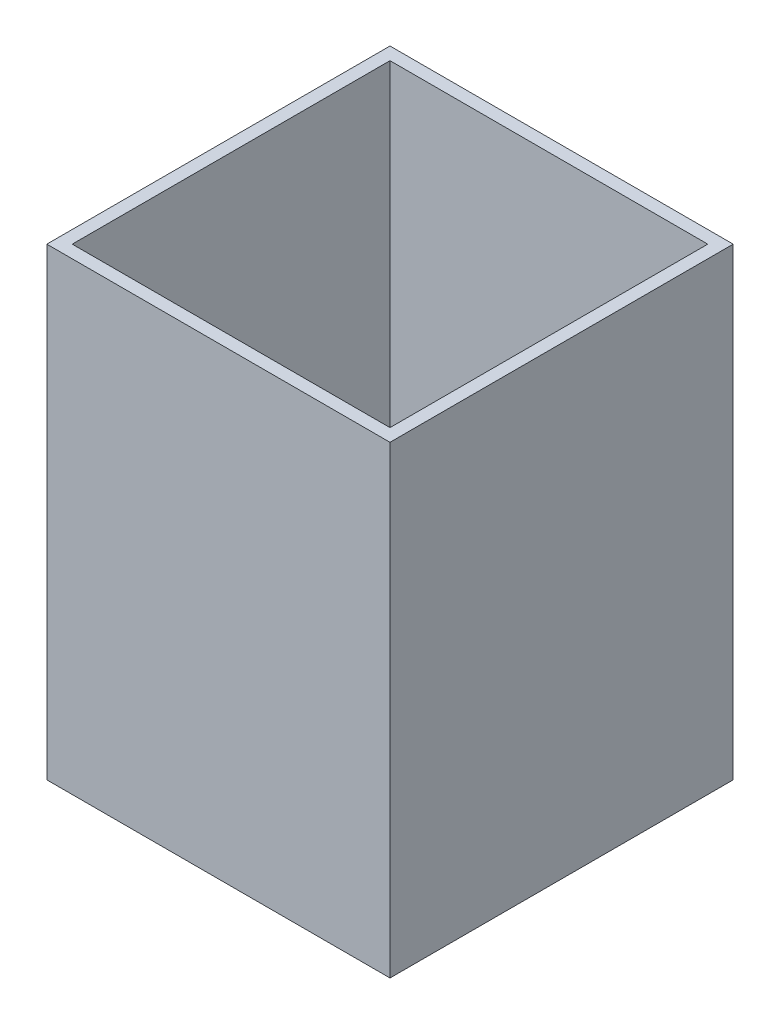
ISO-10303-21;
HEADER;
FILE_DESCRIPTION(('STEP AP214'),'2;1');
FILE_NAME('part.step','',(''),(''),'','','');
FILE_SCHEMA(('AUTOMOTIVE_DESIGN { 1 0 10303 214 1 1 1 1 }'));
ENDSEC;
DATA;
#1=APPLICATION_CONTEXT('core data for automotive mechanical design processes');
#2=APPLICATION_PROTOCOL_DEFINITION('international standard','automotive_design',2000,#1);
#3=PRODUCT_CONTEXT('',#1,'mechanical');
#4=PRODUCT('Part','Part','',(#3));
#5=PRODUCT_RELATED_PRODUCT_CATEGORY('part','',(#4));
#6=PRODUCT_DEFINITION_FORMATION('','',#4);
#7=PRODUCT_DEFINITION_CONTEXT('part definition',#1,'design');
#8=PRODUCT_DEFINITION('design','',#6,#7);
#9=PRODUCT_DEFINITION_SHAPE('','',#8);
#10=(LENGTH_UNIT() NAMED_UNIT(*) SI_UNIT(.MILLI.,.METRE.));
#11=(NAMED_UNIT(*) PLANE_ANGLE_UNIT() SI_UNIT($,.RADIAN.));
#12=(NAMED_UNIT(*) SI_UNIT($,.STERADIAN.) SOLID_ANGLE_UNIT());
#13=UNCERTAINTY_MEASURE_WITH_UNIT(LENGTH_MEASURE(1.E-05),#10,'distance_accuracy_value','');
#14=(GEOMETRIC_REPRESENTATION_CONTEXT(3) GLOBAL_UNCERTAINTY_ASSIGNED_CONTEXT((#13)) GLOBAL_UNIT_ASSIGNED_CONTEXT((#10,
#11,#12)) REPRESENTATION_CONTEXT('',''));
#15=CARTESIAN_POINT('',(0.,0.,0.));
#16=DIRECTION('',(0.,0.,1.));
#17=DIRECTION('',(1.,0.,0.));
#18=AXIS2_PLACEMENT_3D('',#15,#16,#17);
#19=CARTESIAN_POINT('',(0.,0.,0.));
#20=DIRECTION('',(0.,-1.,0.));
#21=DIRECTION('',(0.,0.,-1.));
#22=AXIS2_PLACEMENT_3D('',#19,#20,#21);
#23=PLANE('',#22);
#24=DIRECTION('',(0.,0.,-1.));
#25=VECTOR('',#24,1.);
#26=CARTESIAN_POINT('',(27.,0.,27.));
#27=LINE('',#26,#25);
#28=CARTESIAN_POINT('',(27.,0.,27.));
#29=VERTEX_POINT('',#28);
#30=CARTESIAN_POINT('',(27.,0.,-27.));
#31=VERTEX_POINT('',#30);
#32=EDGE_CURVE('E132',#29,#31,#27,.T.);
#33=ORIENTED_EDGE('',*,*,#32,.F.);
#34=DIRECTION('',(1.,0.,0.));
#35=VECTOR('',#34,1.);
#36=CARTESIAN_POINT('',(-27.,0.,27.));
#37=LINE('',#36,#35);
#38=CARTESIAN_POINT('',(-27.,0.,27.));
#39=VERTEX_POINT('',#38);
#40=EDGE_CURVE('E222',#39,#29,#37,.T.);
#41=ORIENTED_EDGE('',*,*,#40,.F.);
#42=DIRECTION('',(0.,0.,1.));
#43=VECTOR('',#42,1.);
#44=CARTESIAN_POINT('',(-27.,0.,27.));
#45=LINE('',#44,#43);
#46=CARTESIAN_POINT('',(-27.,0.,-27.));
#47=VERTEX_POINT('',#46);
#48=EDGE_CURVE('E220',#47,#39,#45,.T.);
#49=ORIENTED_EDGE('',*,*,#48,.F.);
#50=DIRECTION('',(-1.,0.,0.));
#51=VECTOR('',#50,1.);
#52=CARTESIAN_POINT('',(-27.,0.,-27.));
#53=LINE('',#52,#51);
#54=EDGE_CURVE('E218',#31,#47,#53,.T.);
#55=ORIENTED_EDGE('',*,*,#54,.F.);
#56=EDGE_LOOP('',(#33,#41,#49,#55));
#57=FACE_BOUND('',#56,.T.);
#58=DIRECTION('',(1.,0.,0.));
#59=VECTOR('',#58,1.);
#60=CARTESIAN_POINT('',(-25.,0.,25.));
#61=LINE('',#60,#59);
#62=CARTESIAN_POINT('',(-25.,0.,25.));
#63=VERTEX_POINT('',#62);
#64=CARTESIAN_POINT('',(25.,0.,25.));
#65=VERTEX_POINT('',#64);
#66=EDGE_CURVE('E191',#63,#65,#61,.T.);
#67=ORIENTED_EDGE('',*,*,#66,.T.);
#68=DIRECTION('',(0.,0.,-1.));
#69=VECTOR('',#68,1.);
#70=CARTESIAN_POINT('',(25.,0.,25.));
#71=LINE('',#70,#69);
#72=CARTESIAN_POINT('',(25.,0.,-25.));
#73=VERTEX_POINT('',#72);
#74=EDGE_CURVE('E58',#65,#73,#71,.T.);
#75=ORIENTED_EDGE('',*,*,#74,.T.);
#76=DIRECTION('',(-1.,0.,0.));
#77=VECTOR('',#76,1.);
#78=CARTESIAN_POINT('',(-25.,0.,-25.));
#79=LINE('',#78,#77);
#80=CARTESIAN_POINT('',(-25.,0.,-25.));
#81=VERTEX_POINT('',#80);
#82=EDGE_CURVE('E202',#73,#81,#79,.T.);
#83=ORIENTED_EDGE('',*,*,#82,.T.);
#84=DIRECTION('',(0.,0.,1.));
#85=VECTOR('',#84,1.);
#86=CARTESIAN_POINT('',(-25.,0.,25.));
#87=LINE('',#86,#85);
#88=EDGE_CURVE('E205',#81,#63,#87,.T.);
#89=ORIENTED_EDGE('',*,*,#88,.T.);
#90=EDGE_LOOP('',(#67,#75,#83,#89));
#91=FACE_BOUND('',#90,.T.);
#92=ADVANCED_FACE('F35',(#57,#91),#23,.T.);
#93=CARTESIAN_POINT('',(27.,22.,27.));
#94=DIRECTION('',(-1.,0.,0.));
#95=DIRECTION('',(0.,0.,1.));
#96=AXIS2_PLACEMENT_3D('',#93,#94,#95);
#97=PLANE('',#96);
#98=ORIENTED_EDGE('',*,*,#32,.T.);
#99=DIRECTION('',(0.,-1.,0.));
#100=VECTOR('',#99,1.);
#101=CARTESIAN_POINT('',(27.,22.,-27.));
#102=LINE('',#101,#100);
#103=CARTESIAN_POINT('',(27.,73.,-27.));
#104=VERTEX_POINT('',#103);
#105=EDGE_CURVE('E11',#104,#31,#102,.T.);
#106=ORIENTED_EDGE('',*,*,#105,.F.);
#107=DIRECTION('',(0.,0.,-1.));
#108=VECTOR('',#107,1.);
#109=CARTESIAN_POINT('',(27.,73.,0.));
#110=LINE('',#109,#108);
#111=CARTESIAN_POINT('',(27.,73.,27.));
#112=VERTEX_POINT('',#111);
#113=EDGE_CURVE('E130',#112,#104,#110,.T.);
#114=ORIENTED_EDGE('',*,*,#113,.F.);
#115=DIRECTION('',(0.,-1.,0.));
#116=VECTOR('',#115,1.);
#117=CARTESIAN_POINT('',(27.,22.,27.));
#118=LINE('',#117,#116);
#119=EDGE_CURVE('E224',#112,#29,#118,.T.);
#120=ORIENTED_EDGE('',*,*,#119,.T.);
#121=EDGE_LOOP('',(#98,#106,#114,#120));
#122=FACE_BOUND('',#121,.T.);
#123=ADVANCED_FACE('F37',(#122),#97,.F.);
#124=CARTESIAN_POINT('',(-27.,22.,-27.));
#125=DIRECTION('',(0.,0.,1.));
#126=DIRECTION('',(1.,0.,0.));
#127=AXIS2_PLACEMENT_3D('',#124,#125,#126);
#128=PLANE('',#127);
#129=ORIENTED_EDGE('',*,*,#54,.T.);
#130=DIRECTION('',(0.,-1.,0.));
#131=VECTOR('',#130,1.);
#132=CARTESIAN_POINT('',(-27.,22.,-27.));
#133=LINE('',#132,#131);
#134=CARTESIAN_POINT('',(-27.,73.,-27.));
#135=VERTEX_POINT('',#134);
#136=EDGE_CURVE('E43',#135,#47,#133,.T.);
#137=ORIENTED_EDGE('',*,*,#136,.F.);
#138=DIRECTION('',(-1.,0.,0.));
#139=VECTOR('',#138,1.);
#140=CARTESIAN_POINT('',(0.,73.,-27.));
#141=LINE('',#140,#139);
#142=EDGE_CURVE('E135',#104,#135,#141,.T.);
#143=ORIENTED_EDGE('',*,*,#142,.F.);
#144=ORIENTED_EDGE('',*,*,#105,.T.);
#145=EDGE_LOOP('',(#129,#137,#143,#144));
#146=FACE_BOUND('',#145,.T.);
#147=ADVANCED_FACE('F136',(#146),#128,.F.);
#148=CARTESIAN_POINT('',(-27.,22.,27.));
#149=DIRECTION('',(1.,0.,0.));
#150=DIRECTION('',(0.,0.,-1.));
#151=AXIS2_PLACEMENT_3D('',#148,#149,#150);
#152=PLANE('',#151);
#153=ORIENTED_EDGE('',*,*,#48,.T.);
#154=DIRECTION('',(0.,-1.,0.));
#155=VECTOR('',#154,1.);
#156=CARTESIAN_POINT('',(-27.,22.,27.));
#157=LINE('',#156,#155);
#158=CARTESIAN_POINT('',(-27.,73.,27.));
#159=VERTEX_POINT('',#158);
#160=EDGE_CURVE('E226',#159,#39,#157,.T.);
#161=ORIENTED_EDGE('',*,*,#160,.F.);
#162=DIRECTION('',(0.,0.,1.));
#163=VECTOR('',#162,1.);
#164=CARTESIAN_POINT('',(-27.,73.,0.));
#165=LINE('',#164,#163);
#166=EDGE_CURVE('E141',#135,#159,#165,.T.);
#167=ORIENTED_EDGE('',*,*,#166,.F.);
#168=ORIENTED_EDGE('',*,*,#136,.T.);
#169=EDGE_LOOP('',(#153,#161,#167,#168));
#170=FACE_BOUND('',#169,.T.);
#171=ADVANCED_FACE('F230',(#170),#152,.F.);
#172=CARTESIAN_POINT('',(-27.,22.,27.));
#173=DIRECTION('',(0.,0.,-1.));
#174=DIRECTION('',(-1.,0.,0.));
#175=AXIS2_PLACEMENT_3D('',#172,#173,#174);
#176=PLANE('',#175);
#177=ORIENTED_EDGE('',*,*,#40,.T.);
#178=ORIENTED_EDGE('',*,*,#119,.F.);
#179=DIRECTION('',(1.,0.,0.));
#180=VECTOR('',#179,1.);
#181=CARTESIAN_POINT('',(0.,73.,27.));
#182=LINE('',#181,#180);
#183=EDGE_CURVE('E147',#159,#112,#182,.T.);
#184=ORIENTED_EDGE('',*,*,#183,.F.);
#185=ORIENTED_EDGE('',*,*,#160,.T.);
#186=EDGE_LOOP('',(#177,#178,#184,#185));
#187=FACE_BOUND('',#186,.T.);
#188=ADVANCED_FACE('F235',(#187),#176,.F.);
#189=CARTESIAN_POINT('',(25.,22.,25.));
#190=DIRECTION('',(-1.,0.,0.));
#191=DIRECTION('',(0.,0.,1.));
#192=AXIS2_PLACEMENT_3D('',#189,#190,#191);
#193=PLANE('',#192);
#194=ORIENTED_EDGE('',*,*,#74,.F.);
#195=DIRECTION('',(0.,-1.,0.));
#196=VECTOR('',#195,1.);
#197=CARTESIAN_POINT('',(25.,22.,25.));
#198=LINE('',#197,#196);
#199=CARTESIAN_POINT('',(25.,22.,25.));
#200=VERTEX_POINT('',#199);
#201=EDGE_CURVE('E200',#200,#65,#198,.T.);
#202=ORIENTED_EDGE('',*,*,#201,.F.);
#203=DIRECTION('',(0.,0.,-1.));
#204=VECTOR('',#203,1.);
#205=CARTESIAN_POINT('',(25.,22.,25.));
#206=LINE('',#205,#204);
#207=CARTESIAN_POINT('',(25.,22.,-25.));
#208=VERTEX_POINT('',#207);
#209=EDGE_CURVE('E187',#200,#208,#206,.T.);
#210=ORIENTED_EDGE('',*,*,#209,.T.);
#211=DIRECTION('',(0.,-1.,0.));
#212=VECTOR('',#211,1.);
#213=CARTESIAN_POINT('',(25.,22.,-25.));
#214=LINE('',#213,#212);
#215=EDGE_CURVE('E215',#208,#73,#214,.T.);
#216=ORIENTED_EDGE('',*,*,#215,.T.);
#217=EDGE_LOOP('',(#194,#202,#210,#216));
#218=FACE_BOUND('',#217,.T.);
#219=ADVANCED_FACE('F237',(#218),#193,.T.);
#220=CARTESIAN_POINT('',(-25.,22.,-25.));
#221=DIRECTION('',(0.,0.,1.));
#222=DIRECTION('',(1.,0.,0.));
#223=AXIS2_PLACEMENT_3D('',#220,#221,#222);
#224=PLANE('',#223);
#225=ORIENTED_EDGE('',*,*,#82,.F.);
#226=ORIENTED_EDGE('',*,*,#215,.F.);
#227=DIRECTION('',(-1.,0.,0.));
#228=VECTOR('',#227,1.);
#229=CARTESIAN_POINT('',(-25.,22.,-25.));
#230=LINE('',#229,#228);
#231=CARTESIAN_POINT('',(-25.,22.,-25.));
#232=VERTEX_POINT('',#231);
#233=EDGE_CURVE('E190',#208,#232,#230,.T.);
#234=ORIENTED_EDGE('',*,*,#233,.T.);
#235=DIRECTION('',(0.,-1.,0.));
#236=VECTOR('',#235,1.);
#237=CARTESIAN_POINT('',(-25.,22.,-25.));
#238=LINE('',#237,#236);
#239=EDGE_CURVE('E213',#232,#81,#238,.T.);
#240=ORIENTED_EDGE('',*,*,#239,.T.);
#241=EDGE_LOOP('',(#225,#226,#234,#240));
#242=FACE_BOUND('',#241,.T.);
#243=ADVANCED_FACE('F243',(#242),#224,.T.);
#244=CARTESIAN_POINT('',(-25.,22.,25.));
#245=DIRECTION('',(1.,0.,0.));
#246=DIRECTION('',(0.,0.,-1.));
#247=AXIS2_PLACEMENT_3D('',#244,#245,#246);
#248=PLANE('',#247);
#249=ORIENTED_EDGE('',*,*,#88,.F.);
#250=ORIENTED_EDGE('',*,*,#239,.F.);
#251=DIRECTION('',(0.,0.,1.));
#252=VECTOR('',#251,1.);
#253=CARTESIAN_POINT('',(-25.,22.,25.));
#254=LINE('',#253,#252);
#255=CARTESIAN_POINT('',(-25.,22.,25.));
#256=VERTEX_POINT('',#255);
#257=EDGE_CURVE('E194',#232,#256,#254,.T.);
#258=ORIENTED_EDGE('',*,*,#257,.T.);
#259=DIRECTION('',(0.,-1.,0.));
#260=VECTOR('',#259,1.);
#261=CARTESIAN_POINT('',(-25.,22.,25.));
#262=LINE('',#261,#260);
#263=EDGE_CURVE('E211',#256,#63,#262,.T.);
#264=ORIENTED_EDGE('',*,*,#263,.T.);
#265=EDGE_LOOP('',(#249,#250,#258,#264));
#266=FACE_BOUND('',#265,.T.);
#267=ADVANCED_FACE('F254',(#266),#248,.T.);
#268=CARTESIAN_POINT('',(-25.,22.,25.));
#269=DIRECTION('',(0.,0.,-1.));
#270=DIRECTION('',(-1.,0.,0.));
#271=AXIS2_PLACEMENT_3D('',#268,#269,#270);
#272=PLANE('',#271);
#273=ORIENTED_EDGE('',*,*,#66,.F.);
#274=ORIENTED_EDGE('',*,*,#263,.F.);
#275=DIRECTION('',(1.,0.,0.));
#276=VECTOR('',#275,1.);
#277=CARTESIAN_POINT('',(-25.,22.,25.));
#278=LINE('',#277,#276);
#279=EDGE_CURVE('E197',#256,#200,#278,.T.);
#280=ORIENTED_EDGE('',*,*,#279,.T.);
#281=ORIENTED_EDGE('',*,*,#201,.T.);
#282=EDGE_LOOP('',(#273,#274,#280,#281));
#283=FACE_BOUND('',#282,.T.);
#284=ADVANCED_FACE('F258',(#283),#272,.T.);
#285=CARTESIAN_POINT('',(0.,22.,0.));
#286=DIRECTION('',(0.,-1.,0.));
#287=DIRECTION('',(0.,0.,-1.));
#288=AXIS2_PLACEMENT_3D('',#285,#286,#287);
#289=PLANE('',#288);
#290=CARTESIAN_POINT('',(0.,22.,0.));
#291=DIRECTION('',(0.,-1.,0.));
#292=DIRECTION('',(0.,0.,-1.));
#293=AXIS2_PLACEMENT_3D('',#290,#291,#292);
#294=CIRCLE('',#293,6.);
#295=CARTESIAN_POINT('',(0.,22.,-6.));
#296=VERTEX_POINT('',#295);
#297=EDGE_CURVE('E184',#296,#296,#294,.T.);
#298=ORIENTED_EDGE('',*,*,#297,.F.);
#299=EDGE_LOOP('',(#298));
#300=FACE_BOUND('',#299,.T.);
#301=ORIENTED_EDGE('',*,*,#209,.F.);
#302=ORIENTED_EDGE('',*,*,#279,.F.);
#303=ORIENTED_EDGE('',*,*,#257,.F.);
#304=ORIENTED_EDGE('',*,*,#233,.F.);
#305=EDGE_LOOP('',(#301,#302,#303,#304));
#306=FACE_BOUND('',#305,.T.);
#307=ADVANCED_FACE('F262',(#300,#306),#289,.T.);
#308=CARTESIAN_POINT('',(0.,23.,0.));
#309=DIRECTION('',(0.,-1.,0.));
#310=DIRECTION('',(0.,0.,-1.));
#311=AXIS2_PLACEMENT_3D('',#308,#309,#310);
#312=PLANE('',#311);
#313=DIRECTION('',(1.,0.,0.));
#314=VECTOR('',#313,1.);
#315=CARTESIAN_POINT('',(0.,23.,-25.));
#316=LINE('',#315,#314);
#317=CARTESIAN_POINT('',(-25.,23.,-25.));
#318=VERTEX_POINT('',#317);
#319=CARTESIAN_POINT('',(25.,23.,-25.));
#320=VERTEX_POINT('',#319);
#321=EDGE_CURVE('E170',#318,#320,#316,.T.);
#322=ORIENTED_EDGE('',*,*,#321,.F.);
#323=DIRECTION('',(0.,0.,1.));
#324=VECTOR('',#323,1.);
#325=CARTESIAN_POINT('',(-25.,23.,0.));
#326=LINE('',#325,#324);
#327=CARTESIAN_POINT('',(-25.,23.,25.));
#328=VERTEX_POINT('',#327);
#329=EDGE_CURVE('E167',#318,#328,#326,.T.);
#330=ORIENTED_EDGE('',*,*,#329,.T.);
#331=DIRECTION('',(1.,0.,0.));
#332=VECTOR('',#331,1.);
#333=CARTESIAN_POINT('',(0.,23.,25.));
#334=LINE('',#333,#332);
#335=CARTESIAN_POINT('',(25.,23.,25.));
#336=VERTEX_POINT('',#335);
#337=EDGE_CURVE('E148',#328,#336,#334,.T.);
#338=ORIENTED_EDGE('',*,*,#337,.T.);
#339=DIRECTION('',(0.,0.,1.));
#340=VECTOR('',#339,1.);
#341=CARTESIAN_POINT('',(25.,23.,0.));
#342=LINE('',#341,#340);
#343=EDGE_CURVE('E50',#320,#336,#342,.T.);
#344=ORIENTED_EDGE('',*,*,#343,.F.);
#345=EDGE_LOOP('',(#322,#330,#338,#344));
#346=FACE_BOUND('',#345,.T.);
#347=CARTESIAN_POINT('',(0.,23.,0.));
#348=DIRECTION('',(0.,1.,0.));
#349=DIRECTION('',(0.,0.,1.));
#350=AXIS2_PLACEMENT_3D('',#347,#348,#349);
#351=CIRCLE('',#350,6.);
#352=CARTESIAN_POINT('',(0.,23.,6.));
#353=VERTEX_POINT('',#352);
#354=EDGE_CURVE('E181',#353,#353,#351,.T.);
#355=ORIENTED_EDGE('',*,*,#354,.F.);
#356=EDGE_LOOP('',(#355));
#357=FACE_BOUND('',#356,.T.);
#358=ADVANCED_FACE('F266',(#346,#357),#312,.F.);
#359=CARTESIAN_POINT('',(0.,0.,0.));
#360=DIRECTION('',(0.,1.,0.));
#361=DIRECTION('',(0.,0.,1.));
#362=AXIS2_PLACEMENT_3D('',#359,#360,#361);
#363=CYLINDRICAL_SURFACE('',#362,6.);
#364=ORIENTED_EDGE('',*,*,#297,.T.);
#365=EDGE_LOOP('',(#364));
#366=FACE_BOUND('',#365,.T.);
#367=ORIENTED_EDGE('',*,*,#354,.T.);
#368=EDGE_LOOP('',(#367));
#369=FACE_BOUND('',#368,.T.);
#370=ADVANCED_FACE('F270',(#366,#369),#363,.F.);
#371=CARTESIAN_POINT('',(-25.,73.,0.));
#372=DIRECTION('',(1.,0.,0.));
#373=DIRECTION('',(0.,0.,-1.));
#374=AXIS2_PLACEMENT_3D('',#371,#372,#373);
#375=PLANE('',#374);
#376=ORIENTED_EDGE('',*,*,#329,.F.);
#377=DIRECTION('',(0.,-1.,0.));
#378=VECTOR('',#377,1.);
#379=CARTESIAN_POINT('',(-25.,73.,-25.));
#380=LINE('',#379,#378);
#381=CARTESIAN_POINT('',(-25.,73.,-25.));
#382=VERTEX_POINT('',#381);
#383=EDGE_CURVE('E179',#382,#318,#380,.T.);
#384=ORIENTED_EDGE('',*,*,#383,.F.);
#385=DIRECTION('',(0.,0.,1.));
#386=VECTOR('',#385,1.);
#387=CARTESIAN_POINT('',(-25.,73.,0.));
#388=LINE('',#387,#386);
#389=CARTESIAN_POINT('',(-25.,73.,25.));
#390=VERTEX_POINT('',#389);
#391=EDGE_CURVE('E155',#382,#390,#388,.T.);
#392=ORIENTED_EDGE('',*,*,#391,.T.);
#393=DIRECTION('',(0.,-1.,0.));
#394=VECTOR('',#393,1.);
#395=CARTESIAN_POINT('',(-25.,73.,25.));
#396=LINE('',#395,#394);
#397=EDGE_CURVE('E166',#390,#328,#396,.T.);
#398=ORIENTED_EDGE('',*,*,#397,.T.);
#399=EDGE_LOOP('',(#376,#384,#392,#398));
#400=FACE_BOUND('',#399,.T.);
#401=ADVANCED_FACE('F274',(#400),#375,.T.);
#402=CARTESIAN_POINT('',(0.,73.,-25.));
#403=DIRECTION('',(0.,0.,-1.));
#404=DIRECTION('',(-1.,0.,0.));
#405=AXIS2_PLACEMENT_3D('',#402,#403,#404);
#406=PLANE('',#405);
#407=ORIENTED_EDGE('',*,*,#321,.T.);
#408=DIRECTION('',(0.,-1.,0.));
#409=VECTOR('',#408,1.);
#410=CARTESIAN_POINT('',(25.,73.,-25.));
#411=LINE('',#410,#409);
#412=CARTESIAN_POINT('',(25.,73.,-25.));
#413=VERTEX_POINT('',#412);
#414=EDGE_CURVE('E177',#413,#320,#411,.T.);
#415=ORIENTED_EDGE('',*,*,#414,.F.);
#416=DIRECTION('',(1.,0.,0.));
#417=VECTOR('',#416,1.);
#418=CARTESIAN_POINT('',(0.,73.,-25.));
#419=LINE('',#418,#417);
#420=EDGE_CURVE('E158',#382,#413,#419,.T.);
#421=ORIENTED_EDGE('',*,*,#420,.F.);
#422=ORIENTED_EDGE('',*,*,#383,.T.);
#423=EDGE_LOOP('',(#407,#415,#421,#422));
#424=FACE_BOUND('',#423,.T.);
#425=ADVANCED_FACE('F278',(#424),#406,.F.);
#426=CARTESIAN_POINT('',(25.,73.,0.));
#427=DIRECTION('',(1.,0.,0.));
#428=DIRECTION('',(0.,0.,-1.));
#429=AXIS2_PLACEMENT_3D('',#426,#427,#428);
#430=PLANE('',#429);
#431=ORIENTED_EDGE('',*,*,#343,.T.);
#432=DIRECTION('',(0.,-1.,0.));
#433=VECTOR('',#432,1.);
#434=CARTESIAN_POINT('',(25.,73.,25.));
#435=LINE('',#434,#433);
#436=CARTESIAN_POINT('',(25.,73.,25.));
#437=VERTEX_POINT('',#436);
#438=EDGE_CURVE('E175',#437,#336,#435,.T.);
#439=ORIENTED_EDGE('',*,*,#438,.F.);
#440=DIRECTION('',(0.,0.,1.));
#441=VECTOR('',#440,1.);
#442=CARTESIAN_POINT('',(25.,73.,0.));
#443=LINE('',#442,#441);
#444=EDGE_CURVE('E161',#413,#437,#443,.T.);
#445=ORIENTED_EDGE('',*,*,#444,.F.);
#446=ORIENTED_EDGE('',*,*,#414,.T.);
#447=EDGE_LOOP('',(#431,#439,#445,#446));
#448=FACE_BOUND('',#447,.T.);
#449=ADVANCED_FACE('F282',(#448),#430,.F.);
#450=CARTESIAN_POINT('',(0.,73.,25.));
#451=DIRECTION('',(0.,0.,-1.));
#452=DIRECTION('',(-1.,0.,0.));
#453=AXIS2_PLACEMENT_3D('',#450,#451,#452);
#454=PLANE('',#453);
#455=ORIENTED_EDGE('',*,*,#337,.F.);
#456=ORIENTED_EDGE('',*,*,#397,.F.);
#457=DIRECTION('',(1.,0.,0.));
#458=VECTOR('',#457,1.);
#459=CARTESIAN_POINT('',(0.,73.,25.));
#460=LINE('',#459,#458);
#461=EDGE_CURVE('E163',#390,#437,#460,.T.);
#462=ORIENTED_EDGE('',*,*,#461,.T.);
#463=ORIENTED_EDGE('',*,*,#438,.T.);
#464=EDGE_LOOP('',(#455,#456,#462,#463));
#465=FACE_BOUND('',#464,.T.);
#466=ADVANCED_FACE('F286',(#465),#454,.T.);
#467=CARTESIAN_POINT('',(0.,73.,0.));
#468=DIRECTION('',(0.,1.,0.));
#469=DIRECTION('',(0.,0.,1.));
#470=AXIS2_PLACEMENT_3D('',#467,#468,#469);
#471=PLANE('',#470);
#472=ORIENTED_EDGE('',*,*,#113,.T.);
#473=ORIENTED_EDGE('',*,*,#142,.T.);
#474=ORIENTED_EDGE('',*,*,#166,.T.);
#475=ORIENTED_EDGE('',*,*,#183,.T.);
#476=EDGE_LOOP('',(#472,#473,#474,#475));
#477=FACE_BOUND('',#476,.T.);
#478=ORIENTED_EDGE('',*,*,#391,.F.);
#479=ORIENTED_EDGE('',*,*,#420,.T.);
#480=ORIENTED_EDGE('',*,*,#444,.T.);
#481=ORIENTED_EDGE('',*,*,#461,.F.);
#482=EDGE_LOOP('',(#478,#479,#480,#481));
#483=FACE_BOUND('',#482,.T.);
#484=ADVANCED_FACE('F144',(#477,#483),#471,.T.);
#485=CLOSED_SHELL('',(#92,#123,#147,#171,#188,#219,#243,#267,#284,#307,#358,#370,#401,#425,#449,
#466,#484));
#486=MANIFOLD_SOLID_BREP('B2',#485);
#487=ADVANCED_BREP_SHAPE_REPRESENTATION('',(#18,#486),#14);
#488=SHAPE_DEFINITION_REPRESENTATION(#9,#487);
ENDSEC;
END-ISO-10303-21;
